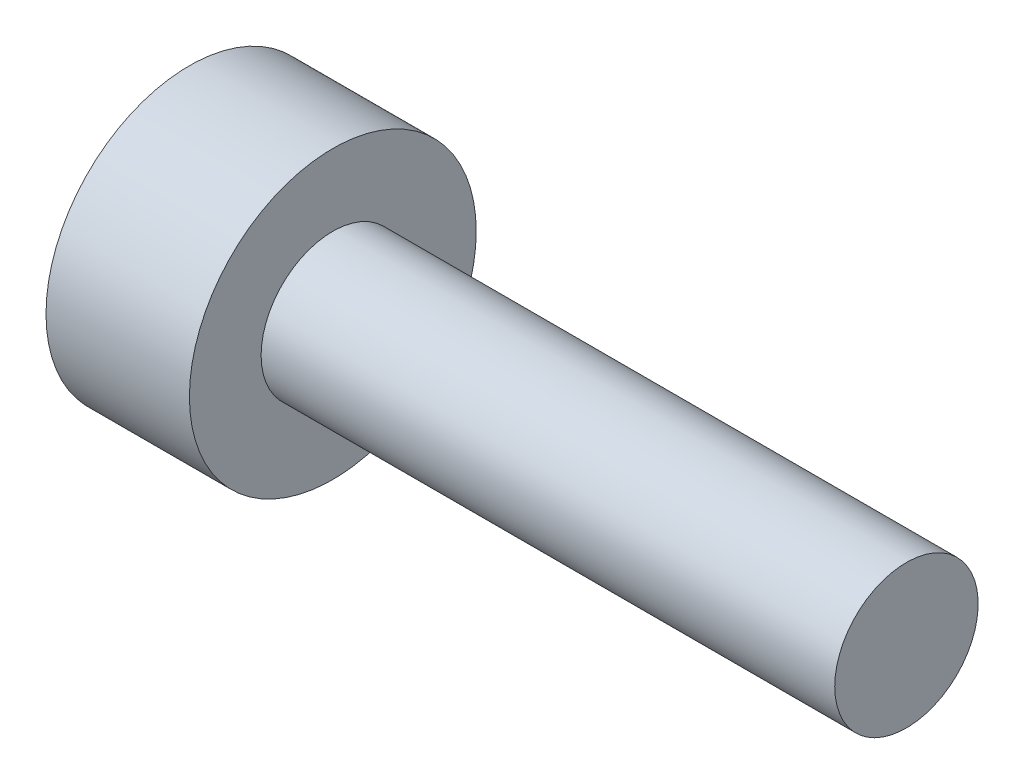
ISO-10303-21;
HEADER;
FILE_DESCRIPTION(('STEP AP214'),'2;1');
FILE_NAME('part.step','',(''),(''),'','','');
FILE_SCHEMA(('AUTOMOTIVE_DESIGN { 1 0 10303 214 1 1 1 1 }'));
ENDSEC;
DATA;
#1=APPLICATION_CONTEXT('core data for automotive mechanical design processes');
#2=APPLICATION_PROTOCOL_DEFINITION('international standard','automotive_design',2000,#1);
#3=PRODUCT_CONTEXT('',#1,'mechanical');
#4=PRODUCT('Part','Part','',(#3));
#5=PRODUCT_RELATED_PRODUCT_CATEGORY('part','',(#4));
#6=PRODUCT_DEFINITION_FORMATION('','',#4);
#7=PRODUCT_DEFINITION_CONTEXT('part definition',#1,'design');
#8=PRODUCT_DEFINITION('design','',#6,#7);
#9=PRODUCT_DEFINITION_SHAPE('','',#8);
#10=(LENGTH_UNIT() NAMED_UNIT(*) SI_UNIT(.MILLI.,.METRE.));
#11=(NAMED_UNIT(*) PLANE_ANGLE_UNIT() SI_UNIT($,.RADIAN.));
#12=(NAMED_UNIT(*) SI_UNIT($,.STERADIAN.) SOLID_ANGLE_UNIT());
#13=UNCERTAINTY_MEASURE_WITH_UNIT(LENGTH_MEASURE(1.E-05),#10,'distance_accuracy_value','');
#14=(GEOMETRIC_REPRESENTATION_CONTEXT(3) GLOBAL_UNCERTAINTY_ASSIGNED_CONTEXT((#13)) GLOBAL_UNIT_ASSIGNED_CONTEXT((#10,
#11,#12)) REPRESENTATION_CONTEXT('',''));
#15=CARTESIAN_POINT('',(0.,0.,0.));
#16=DIRECTION('',(0.,0.,1.));
#17=DIRECTION('',(1.,0.,0.));
#18=AXIS2_PLACEMENT_3D('',#15,#16,#17);
#19=CARTESIAN_POINT('',(0.,0.,0.));
#20=DIRECTION('',(1.,0.,0.));
#21=DIRECTION('',(0.,0.,-1.));
#22=AXIS2_PLACEMENT_3D('',#19,#20,#21);
#23=PLANE('',#22);
#24=DIRECTION('',(0.,0.866025403784438,-0.5));
#25=VECTOR('',#24,1.);
#26=CARTESIAN_POINT('',(0.,0.,0.866025403784439));
#27=LINE('',#26,#25);
#28=CARTESIAN_POINT('',(0.,0.,0.866025403784439));
#29=VERTEX_POINT('',#28);
#30=CARTESIAN_POINT('',(0.,0.75,0.433012701892219));
#31=VERTEX_POINT('',#30);
#32=EDGE_CURVE('E119',#29,#31,#27,.T.);
#33=ORIENTED_EDGE('',*,*,#32,.F.);
#34=DIRECTION('',(0.,0.866025403784439,0.5));
#35=VECTOR('',#34,1.);
#36=CARTESIAN_POINT('',(0.,-0.75,0.433012701892219));
#37=LINE('',#36,#35);
#38=CARTESIAN_POINT('',(0.,-0.75,0.433012701892219));
#39=VERTEX_POINT('',#38);
#40=EDGE_CURVE('E45',#39,#29,#37,.T.);
#41=ORIENTED_EDGE('',*,*,#40,.F.);
#42=DIRECTION('',(0.,0.,1.));
#43=VECTOR('',#42,1.);
#44=CARTESIAN_POINT('',(0.,-0.75,-0.433012701892219));
#45=LINE('',#44,#43);
#46=CARTESIAN_POINT('',(0.,-0.75,-0.433012701892219));
#47=VERTEX_POINT('',#46);
#48=EDGE_CURVE('E128',#47,#39,#45,.T.);
#49=ORIENTED_EDGE('',*,*,#48,.F.);
#50=DIRECTION('',(0.,-0.866025403784438,0.5));
#51=VECTOR('',#50,1.);
#52=CARTESIAN_POINT('',(0.,0.,-0.866025403784439));
#53=LINE('',#52,#51);
#54=CARTESIAN_POINT('',(0.,0.,-0.866025403784439));
#55=VERTEX_POINT('',#54);
#56=EDGE_CURVE('E126',#55,#47,#53,.T.);
#57=ORIENTED_EDGE('',*,*,#56,.F.);
#58=DIRECTION('',(0.,-0.866025403784439,-0.5));
#59=VECTOR('',#58,1.);
#60=CARTESIAN_POINT('',(0.,0.75,-0.433012701892219));
#61=LINE('',#60,#59);
#62=CARTESIAN_POINT('',(0.,0.75,-0.433012701892219));
#63=VERTEX_POINT('',#62);
#64=EDGE_CURVE('E93',#63,#55,#61,.T.);
#65=ORIENTED_EDGE('',*,*,#64,.F.);
#66=DIRECTION('',(0.,0.,-1.));
#67=VECTOR('',#66,1.);
#68=CARTESIAN_POINT('',(0.,0.75,0.433012701892219));
#69=LINE('',#68,#67);
#70=EDGE_CURVE('E122',#31,#63,#69,.T.);
#71=ORIENTED_EDGE('',*,*,#70,.F.);
#72=EDGE_LOOP('',(#33,#41,#49,#57,#65,#71));
#73=FACE_BOUND('',#72,.T.);
#74=CARTESIAN_POINT('',(0.,0.,0.));
#75=DIRECTION('',(-1.,0.,0.));
#76=DIRECTION('',(0.,0.,1.));
#77=AXIS2_PLACEMENT_3D('',#74,#75,#76);
#78=CIRCLE('',#77,2.);
#79=CARTESIAN_POINT('',(0.,0.,2.));
#80=VERTEX_POINT('',#79);
#81=EDGE_CURVE('E11',#80,#80,#78,.T.);
#82=ORIENTED_EDGE('',*,*,#81,.T.);
#83=EDGE_LOOP('',(#82));
#84=FACE_BOUND('',#83,.T.);
#85=ADVANCED_FACE('F31',(#73,#84),#23,.F.);
#86=CARTESIAN_POINT('',(0.,0.,0.));
#87=DIRECTION('',(-1.,0.,0.));
#88=DIRECTION('',(0.,0.,1.));
#89=AXIS2_PLACEMENT_3D('',#86,#87,#88);
#90=CYLINDRICAL_SURFACE('',#89,2.);
#91=ORIENTED_EDGE('',*,*,#81,.F.);
#92=EDGE_LOOP('',(#91));
#93=FACE_BOUND('',#92,.T.);
#94=CARTESIAN_POINT('',(2.,0.,0.));
#95=DIRECTION('',(-1.,0.,0.));
#96=DIRECTION('',(0.,0.,1.));
#97=AXIS2_PLACEMENT_3D('',#94,#95,#96);
#98=CIRCLE('',#97,2.);
#99=CARTESIAN_POINT('',(2.,0.,2.));
#100=VERTEX_POINT('',#99);
#101=EDGE_CURVE('E38',#100,#100,#98,.T.);
#102=ORIENTED_EDGE('',*,*,#101,.T.);
#103=EDGE_LOOP('',(#102));
#104=FACE_BOUND('',#103,.T.);
#105=ADVANCED_FACE('F145',(#93,#104),#90,.T.);
#106=CARTESIAN_POINT('',(2.,2.,0.));
#107=DIRECTION('',(-1.,0.,0.));
#108=DIRECTION('',(0.,0.,1.));
#109=AXIS2_PLACEMENT_3D('',#106,#107,#108);
#110=PLANE('',#109);
#111=ORIENTED_EDGE('',*,*,#101,.F.);
#112=EDGE_LOOP('',(#111));
#113=FACE_BOUND('',#112,.T.);
#114=CARTESIAN_POINT('',(2.,0.,0.));
#115=DIRECTION('',(-1.,0.,0.));
#116=DIRECTION('',(0.,0.,1.));
#117=AXIS2_PLACEMENT_3D('',#114,#115,#116);
#118=CIRCLE('',#117,1.);
#119=CARTESIAN_POINT('',(2.,0.,1.));
#120=VERTEX_POINT('',#119);
#121=EDGE_CURVE('E140',#120,#120,#118,.T.);
#122=ORIENTED_EDGE('',*,*,#121,.T.);
#123=EDGE_LOOP('',(#122));
#124=FACE_BOUND('',#123,.T.);
#125=ADVANCED_FACE('F147',(#113,#124),#110,.F.);
#126=CARTESIAN_POINT('',(0.,0.,0.));
#127=DIRECTION('',(-1.,0.,0.));
#128=DIRECTION('',(0.,0.,1.));
#129=AXIS2_PLACEMENT_3D('',#126,#127,#128);
#130=CYLINDRICAL_SURFACE('',#129,1.);
#131=ORIENTED_EDGE('',*,*,#121,.F.);
#132=EDGE_LOOP('',(#131));
#133=FACE_BOUND('',#132,.T.);
#134=CARTESIAN_POINT('',(10.,0.,0.));
#135=DIRECTION('',(-1.,0.,0.));
#136=DIRECTION('',(0.,0.,1.));
#137=AXIS2_PLACEMENT_3D('',#134,#135,#136);
#138=CIRCLE('',#137,1.);
#139=CARTESIAN_POINT('',(10.,0.,1.));
#140=VERTEX_POINT('',#139);
#141=EDGE_CURVE('E132',#140,#140,#138,.T.);
#142=ORIENTED_EDGE('',*,*,#141,.T.);
#143=EDGE_LOOP('',(#142));
#144=FACE_BOUND('',#143,.T.);
#145=ADVANCED_FACE('F150',(#133,#144),#130,.T.);
#146=CARTESIAN_POINT('',(10.,1.,0.));
#147=DIRECTION('',(-1.,0.,0.));
#148=DIRECTION('',(0.,0.,1.));
#149=AXIS2_PLACEMENT_3D('',#146,#147,#148);
#150=PLANE('',#149);
#151=ORIENTED_EDGE('',*,*,#141,.F.);
#152=EDGE_LOOP('',(#151));
#153=FACE_BOUND('',#152,.T.);
#154=ADVANCED_FACE('F156',(#153),#150,.F.);
#155=CARTESIAN_POINT('',(1.5,-0.75,0.433012701892219));
#156=DIRECTION('',(0.,-0.5,0.866025403784439));
#157=DIRECTION('',(0.,-0.866025403784439,-0.5));
#158=AXIS2_PLACEMENT_3D('',#155,#156,#157);
#159=PLANE('',#158);
#160=ORIENTED_EDGE('',*,*,#40,.T.);
#161=DIRECTION('',(-1.,0.,0.));
#162=VECTOR('',#161,1.);
#163=CARTESIAN_POINT('',(1.5,0.,0.866025403784439));
#164=LINE('',#163,#162);
#165=CARTESIAN_POINT('',(1.5,0.,0.866025403784439));
#166=VERTEX_POINT('',#165);
#167=EDGE_CURVE('E75',#166,#29,#164,.T.);
#168=ORIENTED_EDGE('',*,*,#167,.F.);
#169=DIRECTION('',(0.,0.866025403784439,0.5));
#170=VECTOR('',#169,1.);
#171=CARTESIAN_POINT('',(1.5,-0.75,0.433012701892219));
#172=LINE('',#171,#170);
#173=CARTESIAN_POINT('',(1.5,-0.75,0.433012701892219));
#174=VERTEX_POINT('',#173);
#175=EDGE_CURVE('E130',#174,#166,#172,.T.);
#176=ORIENTED_EDGE('',*,*,#175,.F.);
#177=DIRECTION('',(-1.,0.,0.));
#178=VECTOR('',#177,1.);
#179=CARTESIAN_POINT('',(1.5,-0.75,0.433012701892219));
#180=LINE('',#179,#178);
#181=EDGE_CURVE('E53',#174,#39,#180,.T.);
#182=ORIENTED_EDGE('',*,*,#181,.T.);
#183=EDGE_LOOP('',(#160,#168,#176,#182));
#184=FACE_BOUND('',#183,.T.);
#185=ADVANCED_FACE('F161',(#184),#159,.F.);
#186=CARTESIAN_POINT('',(1.5,-0.75,-0.433012701892219));
#187=DIRECTION('',(0.,-1.,0.));
#188=DIRECTION('',(0.,0.,-1.));
#189=AXIS2_PLACEMENT_3D('',#186,#187,#188);
#190=PLANE('',#189);
#191=ORIENTED_EDGE('',*,*,#48,.T.);
#192=ORIENTED_EDGE('',*,*,#181,.F.);
#193=DIRECTION('',(0.,0.,1.));
#194=VECTOR('',#193,1.);
#195=CARTESIAN_POINT('',(1.5,-0.75,-0.433012701892219));
#196=LINE('',#195,#194);
#197=CARTESIAN_POINT('',(1.5,-0.75,-0.433012701892219));
#198=VERTEX_POINT('',#197);
#199=EDGE_CURVE('E105',#198,#174,#196,.T.);
#200=ORIENTED_EDGE('',*,*,#199,.F.);
#201=DIRECTION('',(-1.,0.,0.));
#202=VECTOR('',#201,1.);
#203=CARTESIAN_POINT('',(1.5,-0.75,-0.433012701892219));
#204=LINE('',#203,#202);
#205=EDGE_CURVE('E97',#198,#47,#204,.T.);
#206=ORIENTED_EDGE('',*,*,#205,.T.);
#207=EDGE_LOOP('',(#191,#192,#200,#206));
#208=FACE_BOUND('',#207,.T.);
#209=ADVANCED_FACE('F166',(#208),#190,.F.);
#210=CARTESIAN_POINT('',(1.5,0.,-0.866025403784439));
#211=DIRECTION('',(0.,-0.5,-0.866025403784438));
#212=DIRECTION('',(0.,0.866025403784439,-0.5));
#213=AXIS2_PLACEMENT_3D('',#210,#211,#212);
#214=PLANE('',#213);
#215=ORIENTED_EDGE('',*,*,#56,.T.);
#216=ORIENTED_EDGE('',*,*,#205,.F.);
#217=DIRECTION('',(0.,-0.866025403784438,0.5));
#218=VECTOR('',#217,1.);
#219=CARTESIAN_POINT('',(1.5,0.,-0.866025403784439));
#220=LINE('',#219,#218);
#221=CARTESIAN_POINT('',(1.5,0.,-0.866025403784439));
#222=VERTEX_POINT('',#221);
#223=EDGE_CURVE('E101',#222,#198,#220,.T.);
#224=ORIENTED_EDGE('',*,*,#223,.F.);
#225=DIRECTION('',(-1.,0.,0.));
#226=VECTOR('',#225,1.);
#227=CARTESIAN_POINT('',(1.5,0.,-0.866025403784439));
#228=LINE('',#227,#226);
#229=EDGE_CURVE('E86',#222,#55,#228,.T.);
#230=ORIENTED_EDGE('',*,*,#229,.T.);
#231=EDGE_LOOP('',(#215,#216,#224,#230));
#232=FACE_BOUND('',#231,.T.);
#233=ADVANCED_FACE('F102',(#232),#214,.F.);
#234=CARTESIAN_POINT('',(1.5,0.75,-0.433012701892219));
#235=DIRECTION('',(0.,0.5,-0.866025403784438));
#236=DIRECTION('',(0.,0.866025403784439,0.5));
#237=AXIS2_PLACEMENT_3D('',#234,#235,#236);
#238=PLANE('',#237);
#239=ORIENTED_EDGE('',*,*,#64,.T.);
#240=ORIENTED_EDGE('',*,*,#229,.F.);
#241=DIRECTION('',(0.,-0.866025403784439,-0.5));
#242=VECTOR('',#241,1.);
#243=CARTESIAN_POINT('',(1.5,0.75,-0.433012701892219));
#244=LINE('',#243,#242);
#245=CARTESIAN_POINT('',(1.5,0.75,-0.433012701892219));
#246=VERTEX_POINT('',#245);
#247=EDGE_CURVE('E90',#246,#222,#244,.T.);
#248=ORIENTED_EDGE('',*,*,#247,.F.);
#249=DIRECTION('',(-1.,0.,0.));
#250=VECTOR('',#249,1.);
#251=CARTESIAN_POINT('',(1.5,0.75,-0.433012701892219));
#252=LINE('',#251,#250);
#253=EDGE_CURVE('E98',#246,#63,#252,.T.);
#254=ORIENTED_EDGE('',*,*,#253,.T.);
#255=EDGE_LOOP('',(#239,#240,#248,#254));
#256=FACE_BOUND('',#255,.T.);
#257=ADVANCED_FACE('F88',(#256),#238,.F.);
#258=CARTESIAN_POINT('',(1.5,0.75,0.433012701892219));
#259=DIRECTION('',(0.,1.,0.));
#260=DIRECTION('',(0.,0.,1.));
#261=AXIS2_PLACEMENT_3D('',#258,#259,#260);
#262=PLANE('',#261);
#263=ORIENTED_EDGE('',*,*,#70,.T.);
#264=ORIENTED_EDGE('',*,*,#253,.F.);
#265=DIRECTION('',(0.,0.,-1.));
#266=VECTOR('',#265,1.);
#267=CARTESIAN_POINT('',(1.5,0.75,0.433012701892219));
#268=LINE('',#267,#266);
#269=CARTESIAN_POINT('',(1.5,0.75,0.433012701892219));
#270=VERTEX_POINT('',#269);
#271=EDGE_CURVE('E111',#270,#246,#268,.T.);
#272=ORIENTED_EDGE('',*,*,#271,.F.);
#273=DIRECTION('',(-1.,0.,0.));
#274=VECTOR('',#273,1.);
#275=CARTESIAN_POINT('',(1.5,0.75,0.433012701892219));
#276=LINE('',#275,#274);
#277=EDGE_CURVE('E135',#270,#31,#276,.T.);
#278=ORIENTED_EDGE('',*,*,#277,.T.);
#279=EDGE_LOOP('',(#263,#264,#272,#278));
#280=FACE_BOUND('',#279,.T.);
#281=ADVANCED_FACE('F192',(#280),#262,.F.);
#282=CARTESIAN_POINT('',(1.5,0.,0.866025403784439));
#283=DIRECTION('',(0.,0.5,0.866025403784438));
#284=DIRECTION('',(0.,-0.866025403784439,0.5));
#285=AXIS2_PLACEMENT_3D('',#282,#283,#284);
#286=PLANE('',#285);
#287=ORIENTED_EDGE('',*,*,#32,.T.);
#288=ORIENTED_EDGE('',*,*,#277,.F.);
#289=DIRECTION('',(0.,0.866025403784438,-0.5));
#290=VECTOR('',#289,1.);
#291=CARTESIAN_POINT('',(1.5,0.,0.866025403784439));
#292=LINE('',#291,#290);
#293=EDGE_CURVE('E113',#166,#270,#292,.T.);
#294=ORIENTED_EDGE('',*,*,#293,.F.);
#295=ORIENTED_EDGE('',*,*,#167,.T.);
#296=EDGE_LOOP('',(#287,#288,#294,#295));
#297=FACE_BOUND('',#296,.T.);
#298=ADVANCED_FACE('F180',(#297),#286,.F.);
#299=CARTESIAN_POINT('',(1.5,0.,0.866025403784439));
#300=DIRECTION('',(-1.,0.,0.));
#301=DIRECTION('',(0.,0.,1.));
#302=AXIS2_PLACEMENT_3D('',#299,#300,#301);
#303=PLANE('',#302);
#304=ORIENTED_EDGE('',*,*,#175,.T.);
#305=ORIENTED_EDGE('',*,*,#293,.T.);
#306=ORIENTED_EDGE('',*,*,#271,.T.);
#307=ORIENTED_EDGE('',*,*,#247,.T.);
#308=ORIENTED_EDGE('',*,*,#223,.T.);
#309=ORIENTED_EDGE('',*,*,#199,.T.);
#310=EDGE_LOOP('',(#304,#305,#306,#307,#308,#309));
#311=FACE_BOUND('',#310,.T.);
#312=ADVANCED_FACE('F108',(#311),#303,.T.);
#313=CLOSED_SHELL('',(#85,#105,#125,#145,#154,#185,#209,#233,#257,#281,#298,#312));
#314=MANIFOLD_SOLID_BREP('B2',#313);
#315=ADVANCED_BREP_SHAPE_REPRESENTATION('',(#18,#314),#14);
#316=SHAPE_DEFINITION_REPRESENTATION(#9,#315);
ENDSEC;
END-ISO-10303-21;
